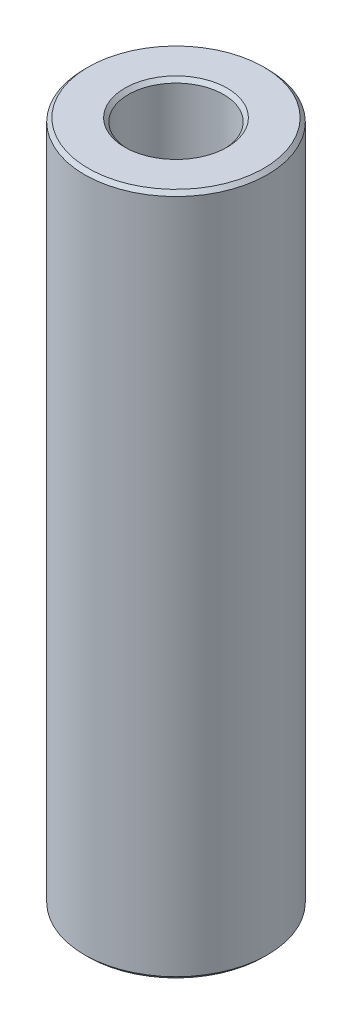
ISO-10303-21;
HEADER;
FILE_DESCRIPTION(('STEP AP214'),'2;1');
FILE_NAME('part.step','',(''),(''),'','','');
FILE_SCHEMA(('AUTOMOTIVE_DESIGN { 1 0 10303 214 1 1 1 1 }'));
ENDSEC;
DATA;
#1=APPLICATION_CONTEXT('core data for automotive mechanical design processes');
#2=APPLICATION_PROTOCOL_DEFINITION('international standard','automotive_design',2000,#1);
#3=PRODUCT_CONTEXT('',#1,'mechanical');
#4=PRODUCT('Part','Part','',(#3));
#5=PRODUCT_RELATED_PRODUCT_CATEGORY('part','',(#4));
#6=PRODUCT_DEFINITION_FORMATION('','',#4);
#7=PRODUCT_DEFINITION_CONTEXT('part definition',#1,'design');
#8=PRODUCT_DEFINITION('design','',#6,#7);
#9=PRODUCT_DEFINITION_SHAPE('','',#8);
#10=(LENGTH_UNIT() NAMED_UNIT(*) SI_UNIT(.MILLI.,.METRE.));
#11=(NAMED_UNIT(*) PLANE_ANGLE_UNIT() SI_UNIT($,.RADIAN.));
#12=(NAMED_UNIT(*) SI_UNIT($,.STERADIAN.) SOLID_ANGLE_UNIT());
#13=UNCERTAINTY_MEASURE_WITH_UNIT(LENGTH_MEASURE(1.E-05),#10,'distance_accuracy_value','');
#14=(GEOMETRIC_REPRESENTATION_CONTEXT(3) GLOBAL_UNCERTAINTY_ASSIGNED_CONTEXT((#13)) GLOBAL_UNIT_ASSIGNED_CONTEXT((#10,
#11,#12)) REPRESENTATION_CONTEXT('',''));
#15=CARTESIAN_POINT('',(0.,0.,0.));
#16=DIRECTION('',(0.,0.,1.));
#17=DIRECTION('',(1.,0.,0.));
#18=AXIS2_PLACEMENT_3D('',#15,#16,#17);
#19=CARTESIAN_POINT('',(0.,0.,7.63785058977719));
#20=DIRECTION('',(0.,1.,0.));
#21=DIRECTION('',(0.,0.,1.));
#22=AXIS2_PLACEMENT_3D('',#19,#20,#21);
#23=CYLINDRICAL_SURFACE('',#22,3.302);
#24=CARTESIAN_POINT('',(0.,0.254000000040833,7.63785058977719));
#25=DIRECTION('',(0.,-1.,0.));
#26=DIRECTION('',(0.,0.,-1.));
#27=AXIS2_PLACEMENT_3D('',#24,#25,#26);
#28=CIRCLE('',#27,3.30200000000859);
#29=CARTESIAN_POINT('',(0.,0.254000000040833,4.3358505897686));
#30=VERTEX_POINT('',#29);
#31=EDGE_CURVE('E33',#30,#30,#28,.T.);
#32=ORIENTED_EDGE('',*,*,#31,.T.);
#33=EDGE_LOOP('',(#32));
#34=FACE_BOUND('',#33,.T.);
#35=CARTESIAN_POINT('',(0.,47.1677999999542,7.63785058977719));
#36=DIRECTION('',(0.,1.,0.));
#37=DIRECTION('',(0.,0.,1.));
#38=AXIS2_PLACEMENT_3D('',#35,#36,#37);
#39=CIRCLE('',#38,3.30200000002987);
#40=CARTESIAN_POINT('',(0.,47.1677999999542,10.9398505898071));
#41=VERTEX_POINT('',#40);
#42=EDGE_CURVE('E30',#41,#41,#39,.T.);
#43=ORIENTED_EDGE('',*,*,#42,.T.);
#44=EDGE_LOOP('',(#43));
#45=FACE_BOUND('',#44,.T.);
#46=ADVANCED_FACE('F15',(#34,#45),#23,.F.);
#47=CARTESIAN_POINT('',(0.,1.13686837721616E-10,7.63785058977719));
#48=DIRECTION('',(0.,-1.,0.));
#49=DIRECTION('',(0.,0.,-1.));
#50=AXIS2_PLACEMENT_3D('',#47,#48,#49);
#51=CONICAL_SURFACE('',#50,3.55599999993574,0.785398163397448);
#52=CARTESIAN_POINT('',(0.,5.6843418860808E-11,7.63785058977719));
#53=DIRECTION('',(0.,-1.,0.));
#54=DIRECTION('',(0.,0.,-1.));
#55=AXIS2_PLACEMENT_3D('',#52,#53,#54);
#56=CIRCLE('',#55,3.55599999999258);
#57=CARTESIAN_POINT('',(0.,5.6843418860808E-11,4.08185058978461));
#58=VERTEX_POINT('',#57);
#59=EDGE_CURVE('E18',#58,#58,#56,.T.);
#60=ORIENTED_EDGE('',*,*,#59,.T.);
#61=EDGE_LOOP('',(#60));
#62=FACE_BOUND('',#61,.T.);
#63=ORIENTED_EDGE('',*,*,#31,.F.);
#64=EDGE_LOOP('',(#63));
#65=FACE_BOUND('',#64,.T.);
#66=ADVANCED_FACE('F47',(#62,#65),#51,.F.);
#67=CARTESIAN_POINT('',(0.,47.4218000000519,7.63785058977719));
#68=DIRECTION('',(0.,1.,0.));
#69=DIRECTION('',(0.,0.,1.));
#70=AXIS2_PLACEMENT_3D('',#67,#68,#69);
#71=CONICAL_SURFACE('',#70,3.55600000012755,0.785398163397448);
#72=ORIENTED_EDGE('',*,*,#42,.F.);
#73=EDGE_LOOP('',(#72));
#74=FACE_BOUND('',#73,.T.);
#75=CARTESIAN_POINT('',(0.,47.4217999999951,7.63785058977719));
#76=DIRECTION('',(0.,1.,0.));
#77=DIRECTION('',(0.,0.,1.));
#78=AXIS2_PLACEMENT_3D('',#75,#76,#77);
#79=CIRCLE('',#78,3.55600000007071);
#80=CARTESIAN_POINT('',(0.,47.4217999999951,11.1938505898479));
#81=VERTEX_POINT('',#80);
#82=EDGE_CURVE('E40',#81,#81,#79,.T.);
#83=ORIENTED_EDGE('',*,*,#82,.T.);
#84=EDGE_LOOP('',(#83));
#85=FACE_BOUND('',#84,.T.);
#86=ADVANCED_FACE('F54',(#74,#85),#71,.F.);
#87=CARTESIAN_POINT('',(-3.556,0.,7.63785058977719));
#88=DIRECTION('',(0.,1.,0.));
#89=DIRECTION('',(0.,0.,1.));
#90=AXIS2_PLACEMENT_3D('',#87,#88,#89);
#91=PLANE('',#90);
#92=ORIENTED_EDGE('',*,*,#59,.F.);
#93=EDGE_LOOP('',(#92));
#94=FACE_BOUND('',#93,.T.);
#95=CARTESIAN_POINT('',(0.,5.6843418860808E-11,7.63785058977719));
#96=DIRECTION('',(0.,1.,0.));
#97=DIRECTION('',(0.,0.,1.));
#98=AXIS2_PLACEMENT_3D('',#95,#96,#97);
#99=CIRCLE('',#98,6.09600000002429);
#100=CARTESIAN_POINT('',(0.,5.6843418860808E-11,13.7338505898015));
#101=VERTEX_POINT('',#100);
#102=EDGE_CURVE('E38',#101,#101,#99,.T.);
#103=ORIENTED_EDGE('',*,*,#102,.F.);
#104=EDGE_LOOP('',(#103));
#105=FACE_BOUND('',#104,.T.);
#106=ADVANCED_FACE('F50',(#94,#105),#91,.F.);
#107=CARTESIAN_POINT('',(-6.096,47.4218,7.63785058977719));
#108=DIRECTION('',(0.,-1.,0.));
#109=DIRECTION('',(0.,0.,-1.));
#110=AXIS2_PLACEMENT_3D('',#107,#108,#109);
#111=PLANE('',#110);
#112=CARTESIAN_POINT('',(0.,47.4218000000519,7.63785058977719));
#113=DIRECTION('',(0.,-1.,0.));
#114=DIRECTION('',(0.,0.,-1.));
#115=AXIS2_PLACEMENT_3D('',#112,#113,#114);
#116=CIRCLE('',#115,6.09599999994616);
#117=CARTESIAN_POINT('',(0.,47.4218000000519,1.54185058983103));
#118=VERTEX_POINT('',#117);
#119=EDGE_CURVE('E27',#118,#118,#116,.T.);
#120=ORIENTED_EDGE('',*,*,#119,.F.);
#121=EDGE_LOOP('',(#120));
#122=FACE_BOUND('',#121,.T.);
#123=ORIENTED_EDGE('',*,*,#82,.F.);
#124=EDGE_LOOP('',(#123));
#125=FACE_BOUND('',#124,.T.);
#126=ADVANCED_FACE('F53',(#122,#125),#111,.F.);
#127=CARTESIAN_POINT('',(0.,0.253999999927146,7.63785058977719));
#128=DIRECTION('',(0.,1.,0.));
#129=DIRECTION('',(0.,0.,1.));
#130=AXIS2_PLACEMENT_3D('',#127,#128,#129);
#131=CONICAL_SURFACE('',#130,6.34999999989459,0.785398163397448);
#132=CARTESIAN_POINT('',(0.,0.254,7.63785058977719));
#133=DIRECTION('',(0.,1.,0.));
#134=DIRECTION('',(0.,0.,1.));
#135=AXIS2_PLACEMENT_3D('',#132,#133,#134);
#136=CIRCLE('',#135,6.35);
#137=CARTESIAN_POINT('',(0.,0.254,13.9878505897772));
#138=VERTEX_POINT('',#137);
#139=EDGE_CURVE('E22',#138,#138,#136,.T.);
#140=ORIENTED_EDGE('',*,*,#139,.F.);
#141=EDGE_LOOP('',(#140));
#142=FACE_BOUND('',#141,.T.);
#143=ORIENTED_EDGE('',*,*,#102,.T.);
#144=EDGE_LOOP('',(#143));
#145=FACE_BOUND('',#144,.T.);
#146=ADVANCED_FACE('F58',(#142,#145),#131,.T.);
#147=CARTESIAN_POINT('',(0.,47.1678000000679,7.63785058977719));
#148=DIRECTION('',(0.,-1.,0.));
#149=DIRECTION('',(0.,0.,-1.));
#150=AXIS2_PLACEMENT_3D('',#147,#148,#149);
#151=CONICAL_SURFACE('',#150,6.34999999993015,0.785398163397448);
#152=CARTESIAN_POINT('',(0.,47.1678,7.63785058977719));
#153=DIRECTION('',(0.,1.,0.));
#154=DIRECTION('',(0.,0.,1.));
#155=AXIS2_PLACEMENT_3D('',#152,#153,#154);
#156=CIRCLE('',#155,6.35);
#157=CARTESIAN_POINT('',(0.,47.1678,13.9878505897772));
#158=VERTEX_POINT('',#157);
#159=EDGE_CURVE('E10',#158,#158,#156,.F.);
#160=ORIENTED_EDGE('',*,*,#159,.F.);
#161=EDGE_LOOP('',(#160));
#162=FACE_BOUND('',#161,.T.);
#163=ORIENTED_EDGE('',*,*,#119,.T.);
#164=EDGE_LOOP('',(#163));
#165=FACE_BOUND('',#164,.T.);
#166=ADVANCED_FACE('F60',(#162,#165),#151,.T.);
#167=CARTESIAN_POINT('',(0.,0.,7.63785058977719));
#168=DIRECTION('',(0.,1.,0.));
#169=DIRECTION('',(0.,0.,1.));
#170=AXIS2_PLACEMENT_3D('',#167,#168,#169);
#171=CYLINDRICAL_SURFACE('',#170,6.35);
#172=ORIENTED_EDGE('',*,*,#159,.T.);
#173=EDGE_LOOP('',(#172));
#174=FACE_BOUND('',#173,.T.);
#175=ORIENTED_EDGE('',*,*,#139,.T.);
#176=EDGE_LOOP('',(#175));
#177=FACE_BOUND('',#176,.T.);
#178=ADVANCED_FACE('F68',(#174,#177),#171,.T.);
#179=CLOSED_SHELL('',(#46,#66,#86,#106,#126,#146,#166,#178));
#180=MANIFOLD_SOLID_BREP('B1',#179);
#181=ADVANCED_BREP_SHAPE_REPRESENTATION('',(#18,#180),#14);
#182=SHAPE_DEFINITION_REPRESENTATION(#9,#181);
ENDSEC;
END-ISO-10303-21;
